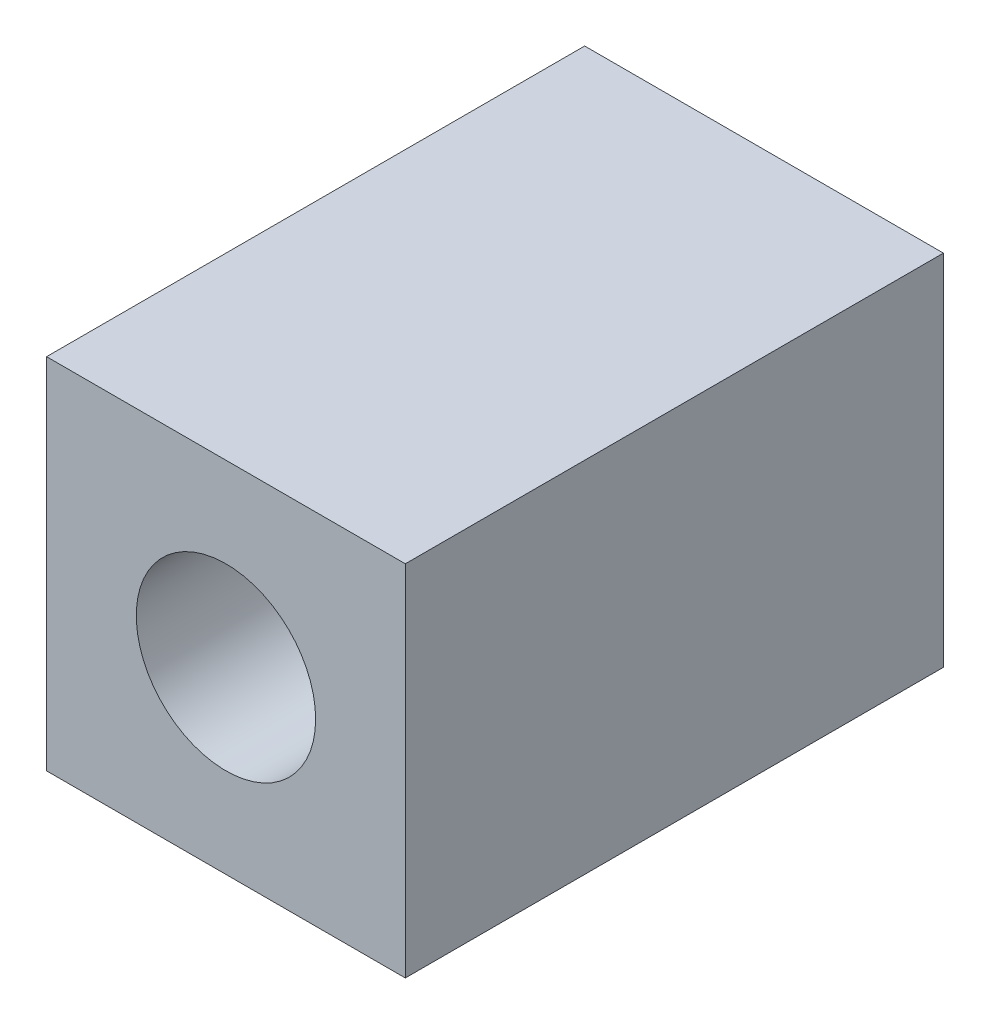
ISO-10303-21;
HEADER;
FILE_DESCRIPTION(('STEP AP214'),'2;1');
FILE_NAME('part.step','',(''),(''),'','','');
FILE_SCHEMA(('AUTOMOTIVE_DESIGN { 1 0 10303 214 1 1 1 1 }'));
ENDSEC;
DATA;
#1=APPLICATION_CONTEXT('core data for automotive mechanical design processes');
#2=APPLICATION_PROTOCOL_DEFINITION('international standard','automotive_design',2000,#1);
#3=PRODUCT_CONTEXT('',#1,'mechanical');
#4=PRODUCT('Part','Part','',(#3));
#5=PRODUCT_RELATED_PRODUCT_CATEGORY('part','',(#4));
#6=PRODUCT_DEFINITION_FORMATION('','',#4);
#7=PRODUCT_DEFINITION_CONTEXT('part definition',#1,'design');
#8=PRODUCT_DEFINITION('design','',#6,#7);
#9=PRODUCT_DEFINITION_SHAPE('','',#8);
#10=(LENGTH_UNIT() NAMED_UNIT(*) SI_UNIT(.MILLI.,.METRE.));
#11=(NAMED_UNIT(*) PLANE_ANGLE_UNIT() SI_UNIT($,.RADIAN.));
#12=(NAMED_UNIT(*) SI_UNIT($,.STERADIAN.) SOLID_ANGLE_UNIT());
#13=UNCERTAINTY_MEASURE_WITH_UNIT(LENGTH_MEASURE(1.E-05),#10,'distance_accuracy_value','');
#14=(GEOMETRIC_REPRESENTATION_CONTEXT(3) GLOBAL_UNCERTAINTY_ASSIGNED_CONTEXT((#13)) GLOBAL_UNIT_ASSIGNED_CONTEXT((#10,
#11,#12)) REPRESENTATION_CONTEXT('',''));
#15=CARTESIAN_POINT('',(0.,0.,0.));
#16=DIRECTION('',(0.,0.,1.));
#17=DIRECTION('',(1.,0.,0.));
#18=AXIS2_PLACEMENT_3D('',#15,#16,#17);
#19=CARTESIAN_POINT('',(-5.,-5.,15.0000000000002));
#20=DIRECTION('',(0.,0.,-1.));
#21=DIRECTION('',(-1.,0.,0.));
#22=AXIS2_PLACEMENT_3D('',#19,#20,#21);
#23=PLANE('',#22);
#24=DIRECTION('',(0.,-1.,0.));
#25=VECTOR('',#24,1.);
#26=CARTESIAN_POINT('',(-5.,-5.,15.0000000000002));
#27=LINE('',#26,#25);
#28=CARTESIAN_POINT('',(-5.,4.99999999999989,14.9999999999997));
#29=VERTEX_POINT('',#28);
#30=CARTESIAN_POINT('',(-5.,-5.,15.0000000000002));
#31=VERTEX_POINT('',#30);
#32=EDGE_CURVE('E95',#29,#31,#27,.T.);
#33=ORIENTED_EDGE('',*,*,#32,.T.);
#34=DIRECTION('',(1.,0.,0.));
#35=VECTOR('',#34,1.);
#36=CARTESIAN_POINT('',(-5.,-5.,15.0000000000002));
#37=LINE('',#36,#35);
#38=CARTESIAN_POINT('',(5.00000000000006,-5.,15.0000000000003));
#39=VERTEX_POINT('',#38);
#40=EDGE_CURVE('E98',#31,#39,#37,.T.);
#41=ORIENTED_EDGE('',*,*,#40,.T.);
#42=DIRECTION('',(0.,1.,0.));
#43=VECTOR('',#42,1.);
#44=CARTESIAN_POINT('',(5.00000000000006,-5.,15.0000000000003));
#45=LINE('',#44,#43);
#46=CARTESIAN_POINT('',(5.00000000000006,4.99999999999989,15.0000000000003));
#47=VERTEX_POINT('',#46);
#48=EDGE_CURVE('E100',#39,#47,#45,.T.);
#49=ORIENTED_EDGE('',*,*,#48,.T.);
#50=DIRECTION('',(-1.,0.,0.));
#51=VECTOR('',#50,1.);
#52=CARTESIAN_POINT('',(-5.,4.99999999999989,14.9999999999997));
#53=LINE('',#52,#51);
#54=EDGE_CURVE('E102',#47,#29,#53,.T.);
#55=ORIENTED_EDGE('',*,*,#54,.T.);
#56=EDGE_LOOP('',(#33,#41,#49,#55));
#57=FACE_BOUND('',#56,.T.);
#58=CARTESIAN_POINT('',(0.,0.,15.0000000000007));
#59=DIRECTION('',(0.,0.,1.));
#60=DIRECTION('',(1.,0.,0.));
#61=AXIS2_PLACEMENT_3D('',#58,#59,#60);
#62=CIRCLE('',#61,2.5);
#63=CARTESIAN_POINT('',(2.49999999999997,0.,15.0000000000006));
#64=VERTEX_POINT('',#63);
#65=EDGE_CURVE('E83',#64,#64,#62,.T.);
#66=ORIENTED_EDGE('',*,*,#65,.F.);
#67=EDGE_LOOP('',(#66));
#68=FACE_BOUND('',#67,.T.);
#69=ADVANCED_FACE('F16',(#57,#68),#23,.F.);
#70=CARTESIAN_POINT('',(-5.,-5.00000000000017,-6.10622663543836E-13));
#71=DIRECTION('',(0.,0.,-1.));
#72=DIRECTION('',(-1.,0.,0.));
#73=AXIS2_PLACEMENT_3D('',#70,#71,#72);
#74=PLANE('',#73);
#75=DIRECTION('',(0.,-1.,0.));
#76=VECTOR('',#75,1.);
#77=CARTESIAN_POINT('',(-5.,-5.00000000000017,-6.10622663543836E-13));
#78=LINE('',#77,#76);
#79=CARTESIAN_POINT('',(-5.00000000000047,4.99999999999984,3.33066907387547E-13));
#80=VERTEX_POINT('',#79);
#81=CARTESIAN_POINT('',(-5.,-5.00000000000017,-6.10622663543836E-13));
#82=VERTEX_POINT('',#81);
#83=EDGE_CURVE('E86',#80,#82,#78,.T.);
#84=ORIENTED_EDGE('',*,*,#83,.F.);
#85=DIRECTION('',(-1.,0.,0.));
#86=VECTOR('',#85,1.);
#87=CARTESIAN_POINT('',(-5.00000000000047,4.99999999999984,3.33066907387547E-13));
#88=LINE('',#87,#86);
#89=CARTESIAN_POINT('',(5.,5.,1.2490009027033E-12));
#90=VERTEX_POINT('',#89);
#91=EDGE_CURVE('E93',#90,#80,#88,.T.);
#92=ORIENTED_EDGE('',*,*,#91,.F.);
#93=DIRECTION('',(0.,1.,0.));
#94=VECTOR('',#93,1.);
#95=CARTESIAN_POINT('',(5.00000000000005,-5.,2.22044604925031E-13));
#96=LINE('',#95,#94);
#97=CARTESIAN_POINT('',(5.00000000000005,-5.,2.22044604925031E-13));
#98=VERTEX_POINT('',#97);
#99=EDGE_CURVE('E91',#98,#90,#96,.T.);
#100=ORIENTED_EDGE('',*,*,#99,.F.);
#101=DIRECTION('',(1.,0.,0.));
#102=VECTOR('',#101,1.);
#103=CARTESIAN_POINT('',(-5.,-5.00000000000017,-6.10622663543836E-13));
#104=LINE('',#103,#102);
#105=EDGE_CURVE('E89',#82,#98,#104,.T.);
#106=ORIENTED_EDGE('',*,*,#105,.F.);
#107=EDGE_LOOP('',(#84,#92,#100,#106));
#108=FACE_BOUND('',#107,.T.);
#109=CARTESIAN_POINT('',(0.,0.,3.33066907387547E-13));
#110=DIRECTION('',(0.,0.,1.));
#111=DIRECTION('',(1.,0.,0.));
#112=AXIS2_PLACEMENT_3D('',#109,#110,#111);
#113=CIRCLE('',#112,2.5);
#114=CARTESIAN_POINT('',(2.5,0.,3.29939940590238E-13));
#115=VERTEX_POINT('',#114);
#116=EDGE_CURVE('E77',#115,#115,#113,.T.);
#117=ORIENTED_EDGE('',*,*,#116,.T.);
#118=EDGE_LOOP('',(#117));
#119=FACE_BOUND('',#118,.T.);
#120=ADVANCED_FACE('F126',(#108,#119),#74,.T.);
#121=CARTESIAN_POINT('',(-5.,-5.,15.0000000000002));
#122=DIRECTION('',(1.,0.,0.));
#123=DIRECTION('',(0.,0.,-1.));
#124=AXIS2_PLACEMENT_3D('',#121,#122,#123);
#125=PLANE('',#124);
#126=CARTESIAN_POINT('',(-5.00000000000047,-1.66533453693773E-13,4.99999999999972));
#127=DIRECTION('',(1.,0.,0.));
#128=DIRECTION('',(0.,0.,-1.));
#129=AXIS2_PLACEMENT_3D('',#126,#127,#128);
#130=CIRCLE('',#129,2.5);
#131=CARTESIAN_POINT('',(-5.00000000000047,-1.68060010352633E-13,2.49999999999972));
#132=VERTEX_POINT('',#131);
#133=EDGE_CURVE('E74',#132,#132,#130,.T.);
#134=ORIENTED_EDGE('',*,*,#133,.T.);
#135=EDGE_LOOP('',(#134));
#136=FACE_BOUND('',#135,.T.);
#137=ORIENTED_EDGE('',*,*,#83,.T.);
#138=DIRECTION('',(0.,0.,-1.));
#139=VECTOR('',#138,1.);
#140=CARTESIAN_POINT('',(-5.,-5.,15.0000000000002));
#141=LINE('',#140,#139);
#142=EDGE_CURVE('E113',#31,#82,#141,.T.);
#143=ORIENTED_EDGE('',*,*,#142,.F.);
#144=ORIENTED_EDGE('',*,*,#32,.F.);
#145=DIRECTION('',(0.,0.,-1.));
#146=VECTOR('',#145,1.);
#147=CARTESIAN_POINT('',(-5.,4.99999999999989,14.9999999999997));
#148=LINE('',#147,#146);
#149=EDGE_CURVE('E104',#29,#80,#148,.T.);
#150=ORIENTED_EDGE('',*,*,#149,.T.);
#151=EDGE_LOOP('',(#137,#143,#144,#150));
#152=FACE_BOUND('',#151,.T.);
#153=ADVANCED_FACE('F18',(#136,#152),#125,.F.);
#154=CARTESIAN_POINT('',(-5.,-5.,15.0000000000002));
#155=DIRECTION('',(0.,1.,0.));
#156=DIRECTION('',(0.,0.,1.));
#157=AXIS2_PLACEMENT_3D('',#154,#155,#156);
#158=PLANE('',#157);
#159=CARTESIAN_POINT('',(-4.78783679369599E-13,-5.00000000000014,4.99999999999937));
#160=DIRECTION('',(0.,1.,0.));
#161=DIRECTION('',(0.,0.,1.));
#162=AXIS2_PLACEMENT_3D('',#159,#160,#161);
#163=CIRCLE('',#162,2.5);
#164=CARTESIAN_POINT('',(-4.81919319784287E-13,-5.00000000000014,7.49999999999937));
#165=VERTEX_POINT('',#164);
#166=EDGE_CURVE('E70',#165,#165,#163,.T.);
#167=ORIENTED_EDGE('',*,*,#166,.T.);
#168=EDGE_LOOP('',(#167));
#169=FACE_BOUND('',#168,.T.);
#170=ORIENTED_EDGE('',*,*,#105,.T.);
#171=DIRECTION('',(0.,0.,-1.));
#172=VECTOR('',#171,1.);
#173=CARTESIAN_POINT('',(5.00000000000006,-5.,15.0000000000003));
#174=LINE('',#173,#172);
#175=EDGE_CURVE('E110',#39,#98,#174,.T.);
#176=ORIENTED_EDGE('',*,*,#175,.F.);
#177=ORIENTED_EDGE('',*,*,#40,.F.);
#178=ORIENTED_EDGE('',*,*,#142,.T.);
#179=EDGE_LOOP('',(#170,#176,#177,#178));
#180=FACE_BOUND('',#179,.T.);
#181=ADVANCED_FACE('F125',(#169,#180),#158,.F.);
#182=CARTESIAN_POINT('',(5.00000000000006,-5.,15.0000000000003));
#183=DIRECTION('',(-1.,0.,0.));
#184=DIRECTION('',(0.,0.,1.));
#185=AXIS2_PLACEMENT_3D('',#182,#183,#184);
#186=PLANE('',#185);
#187=ORIENTED_EDGE('',*,*,#99,.T.);
#188=DIRECTION('',(0.,0.,-1.));
#189=VECTOR('',#188,1.);
#190=CARTESIAN_POINT('',(5.00000000000006,4.99999999999989,15.0000000000003));
#191=LINE('',#190,#189);
#192=EDGE_CURVE('E107',#47,#90,#191,.T.);
#193=ORIENTED_EDGE('',*,*,#192,.F.);
#194=ORIENTED_EDGE('',*,*,#48,.F.);
#195=ORIENTED_EDGE('',*,*,#175,.T.);
#196=EDGE_LOOP('',(#187,#193,#194,#195));
#197=FACE_BOUND('',#196,.T.);
#198=ADVANCED_FACE('F145',(#197),#186,.F.);
#199=CARTESIAN_POINT('',(-5.,4.99999999999989,14.9999999999997));
#200=DIRECTION('',(0.,-1.,0.));
#201=DIRECTION('',(1.,0.,0.));
#202=AXIS2_PLACEMENT_3D('',#199,#200,#201);
#203=PLANE('',#202);
#204=ORIENTED_EDGE('',*,*,#91,.T.);
#205=ORIENTED_EDGE('',*,*,#149,.F.);
#206=ORIENTED_EDGE('',*,*,#54,.F.);
#207=ORIENTED_EDGE('',*,*,#192,.T.);
#208=EDGE_LOOP('',(#204,#205,#206,#207));
#209=FACE_BOUND('',#208,.T.);
#210=ADVANCED_FACE('F143',(#209),#203,.F.);
#211=CARTESIAN_POINT('',(0.,0.,15.0000000000007));
#212=DIRECTION('',(0.,0.,-1.));
#213=DIRECTION('',(-1.,0.,0.));
#214=AXIS2_PLACEMENT_3D('',#211,#212,#213);
#215=CYLINDRICAL_SURFACE('',#214,2.5);
#216=CARTESIAN_POINT('',(-4.78783679369599E-13,-3.33066907387547E-13,4.99999999999953));
#217=DIRECTION('',(0.,0.707106781186548,-0.707106781186551));
#218=DIRECTION('',(0.,-0.707106781186549,-0.707106781186552));
#219=AXIS2_PLACEMENT_3D('',#216,#217,#218);
#220=ELLIPSE('',#219,3.53553390593274,2.5);
#221=CARTESIAN_POINT('',(2.49999999999953,-4.71844785465692E-13,5.00000000000095));
#222=VERTEX_POINT('',#221);
#223=CARTESIAN_POINT('',(-1.76776695296638,-1.76776695296696,3.23223304703325));
#224=VERTEX_POINT('',#223);
#225=EDGE_CURVE('E31',#222,#224,#220,.T.);
#226=ORIENTED_EDGE('',*,*,#225,.F.);
#227=CARTESIAN_POINT('',(-4.78783679369599E-13,-3.33066907387547E-13,4.99999999999953));
#228=DIRECTION('',(0.,-0.707106781186549,-0.707106781186552));
#229=DIRECTION('',(0.,0.707106781186548,-0.707106781186551));
#230=AXIS2_PLACEMENT_3D('',#227,#228,#229);
#231=ELLIPSE('',#230,3.53553390593274,2.5);
#232=CARTESIAN_POINT('',(-1.76776695296636,-1.76776695296654,6.76776695296609));
#233=VERTEX_POINT('',#232);
#234=EDGE_CURVE('E66',#233,#222,#231,.F.);
#235=ORIENTED_EDGE('',*,*,#234,.F.);
#236=CARTESIAN_POINT('',(-4.78783679369599E-13,-3.33066907387547E-13,4.99999999999953));
#237=DIRECTION('',(-0.707106781186551,0.,-0.707106781186551));
#238=DIRECTION('',(0.707106781186552,0.,-0.707106781186553));
#239=AXIS2_PLACEMENT_3D('',#236,#237,#238);
#240=ELLIPSE('',#239,3.53553390593274,2.5);
#241=CARTESIAN_POINT('',(-4.78783679369599E-13,2.49999999999984,4.99999999999972));
#242=VERTEX_POINT('',#241);
#243=EDGE_CURVE('E116',#242,#233,#240,.F.);
#244=ORIENTED_EDGE('',*,*,#243,.F.);
#245=CARTESIAN_POINT('',(-4.78783679369599E-13,-3.33066907387547E-13,4.99999999999953));
#246=DIRECTION('',(0.707106781186552,0.,-0.707106781186553));
#247=DIRECTION('',(-0.707106781186551,0.,-0.707106781186551));
#248=AXIS2_PLACEMENT_3D('',#245,#246,#247);
#249=ELLIPSE('',#248,3.53553390593274,2.5);
#250=EDGE_CURVE('E24',#224,#242,#249,.T.);
#251=ORIENTED_EDGE('',*,*,#250,.F.);
#252=EDGE_LOOP('',(#226,#235,#244,#251));
#253=FACE_BOUND('',#252,.T.);
#254=ORIENTED_EDGE('',*,*,#65,.T.);
#255=EDGE_LOOP('',(#254));
#256=FACE_BOUND('',#255,.T.);
#257=ORIENTED_EDGE('',*,*,#116,.F.);
#258=EDGE_LOOP('',(#257));
#259=FACE_BOUND('',#258,.T.);
#260=ADVANCED_FACE('F72',(#253,#256,#259),#215,.F.);
#261=CARTESIAN_POINT('',(-5.00000000000047,-1.66533453693773E-13,4.99999999999972));
#262=DIRECTION('',(1.,0.,0.));
#263=DIRECTION('',(0.,0.,-1.));
#264=AXIS2_PLACEMENT_3D('',#261,#262,#263);
#265=CYLINDRICAL_SURFACE('',#264,2.5);
#266=ORIENTED_EDGE('',*,*,#243,.T.);
#267=CARTESIAN_POINT('',(-4.78783679369599E-13,-3.33066907387547E-13,4.99999999999953));
#268=DIRECTION('',(0.707106781186551,-0.707106781186549,0.));
#269=DIRECTION('',(0.707106781186551,0.707106781186548,0.));
#270=AXIS2_PLACEMENT_3D('',#267,#268,#269);
#271=ELLIPSE('',#270,3.53553390593274,2.5);
#272=EDGE_CURVE('E11',#233,#224,#271,.T.);
#273=ORIENTED_EDGE('',*,*,#272,.T.);
#274=ORIENTED_EDGE('',*,*,#250,.T.);
#275=EDGE_LOOP('',(#266,#273,#274));
#276=FACE_BOUND('',#275,.T.);
#277=ORIENTED_EDGE('',*,*,#133,.F.);
#278=EDGE_LOOP('',(#277));
#279=FACE_BOUND('',#278,.T.);
#280=ADVANCED_FACE('F117',(#276,#279),#265,.F.);
#281=CARTESIAN_POINT('',(-4.78783679369599E-13,-5.00000000000014,4.99999999999937));
#282=DIRECTION('',(0.,1.,0.));
#283=DIRECTION('',(0.,0.,1.));
#284=AXIS2_PLACEMENT_3D('',#281,#282,#283);
#285=CYLINDRICAL_SURFACE('',#284,2.5);
#286=ORIENTED_EDGE('',*,*,#225,.T.);
#287=ORIENTED_EDGE('',*,*,#272,.F.);
#288=ORIENTED_EDGE('',*,*,#234,.T.);
#289=EDGE_LOOP('',(#286,#287,#288));
#290=FACE_BOUND('',#289,.T.);
#291=ORIENTED_EDGE('',*,*,#166,.F.);
#292=EDGE_LOOP('',(#291));
#293=FACE_BOUND('',#292,.T.);
#294=ADVANCED_FACE('F67',(#290,#293),#285,.F.);
#295=CLOSED_SHELL('',(#69,#120,#153,#181,#198,#210,#260,#280,#294));
#296=MANIFOLD_SOLID_BREP('B1',#295);
#297=ADVANCED_BREP_SHAPE_REPRESENTATION('',(#18,#296),#14);
#298=SHAPE_DEFINITION_REPRESENTATION(#9,#297);
ENDSEC;
END-ISO-10303-21;
